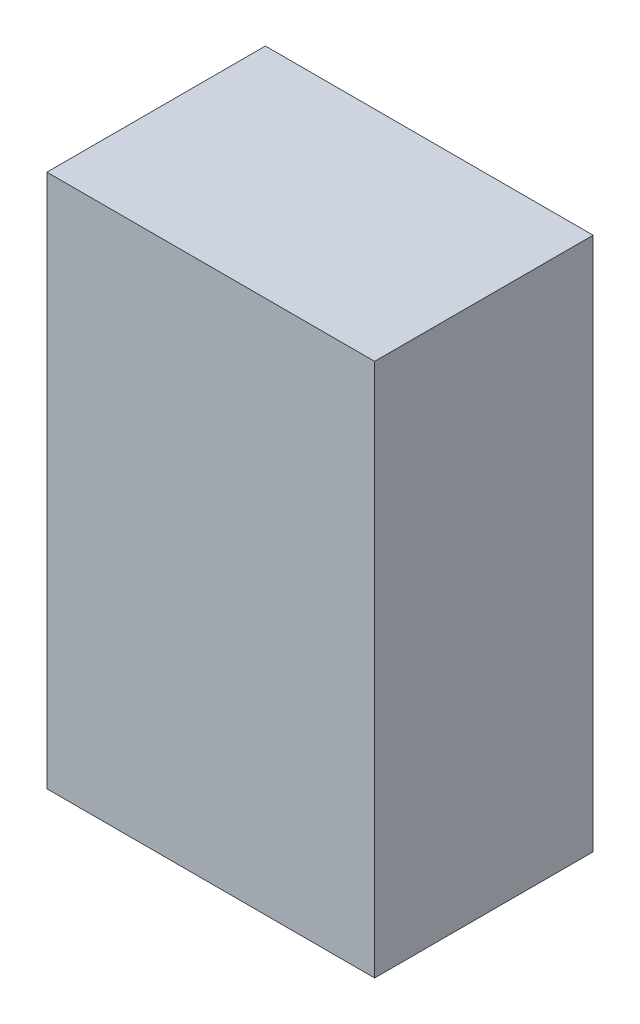
ISO-10303-21;
HEADER;
FILE_DESCRIPTION(('STEP AP214'),'2;1');
FILE_NAME('part.step','',(''),(''),'','','');
FILE_SCHEMA(('AUTOMOTIVE_DESIGN { 1 0 10303 214 1 1 1 1 }'));
ENDSEC;
DATA;
#1=APPLICATION_CONTEXT('core data for automotive mechanical design processes');
#2=APPLICATION_PROTOCOL_DEFINITION('international standard','automotive_design',2000,#1);
#3=PRODUCT_CONTEXT('',#1,'mechanical');
#4=PRODUCT('Part','Part','',(#3));
#5=PRODUCT_RELATED_PRODUCT_CATEGORY('part','',(#4));
#6=PRODUCT_DEFINITION_FORMATION('','',#4);
#7=PRODUCT_DEFINITION_CONTEXT('part definition',#1,'design');
#8=PRODUCT_DEFINITION('design','',#6,#7);
#9=PRODUCT_DEFINITION_SHAPE('','',#8);
#10=(LENGTH_UNIT() NAMED_UNIT(*) SI_UNIT(.MILLI.,.METRE.));
#11=(NAMED_UNIT(*) PLANE_ANGLE_UNIT() SI_UNIT($,.RADIAN.));
#12=(NAMED_UNIT(*) SI_UNIT($,.STERADIAN.) SOLID_ANGLE_UNIT());
#13=UNCERTAINTY_MEASURE_WITH_UNIT(LENGTH_MEASURE(1.E-05),#10,'distance_accuracy_value','');
#14=(GEOMETRIC_REPRESENTATION_CONTEXT(3) GLOBAL_UNCERTAINTY_ASSIGNED_CONTEXT((#13)) GLOBAL_UNIT_ASSIGNED_CONTEXT((#10,
#11,#12)) REPRESENTATION_CONTEXT('',''));
#15=CARTESIAN_POINT('',(0.,0.,0.));
#16=DIRECTION('',(0.,0.,1.));
#17=DIRECTION('',(1.,0.,0.));
#18=AXIS2_PLACEMENT_3D('',#15,#16,#17);
#19=CARTESIAN_POINT('',(-0.67499992,1.10000034,0.90000074));
#20=DIRECTION('',(0.,0.,-1.));
#21=DIRECTION('',(-1.,0.,0.));
#22=AXIS2_PLACEMENT_3D('',#19,#20,#21);
#23=PLANE('',#22);
#24=DIRECTION('',(1.,0.,0.));
#25=VECTOR('',#24,1.);
#26=CARTESIAN_POINT('',(-0.67499992,-1.0999978,0.90000074));
#27=LINE('',#26,#25);
#28=CARTESIAN_POINT('',(-0.67499992,-1.0999978,0.90000074));
#29=VERTEX_POINT('',#28);
#30=CARTESIAN_POINT('',(0.67499992,-1.0999978,0.90000074));
#31=VERTEX_POINT('',#30);
#32=EDGE_CURVE('E55',#29,#31,#27,.T.);
#33=ORIENTED_EDGE('',*,*,#32,.T.);
#34=DIRECTION('',(0.,1.,0.));
#35=VECTOR('',#34,1.);
#36=CARTESIAN_POINT('',(0.67499992,-1.0999978,0.90000074));
#37=LINE('',#36,#35);
#38=CARTESIAN_POINT('',(0.67499992,1.10000034,0.90000074));
#39=VERTEX_POINT('',#38);
#40=EDGE_CURVE('E57',#31,#39,#37,.T.);
#41=ORIENTED_EDGE('',*,*,#40,.T.);
#42=DIRECTION('',(1.,0.,0.));
#43=VECTOR('',#42,1.);
#44=CARTESIAN_POINT('',(0.67499992,1.10000034,0.90000074));
#45=LINE('',#44,#43);
#46=CARTESIAN_POINT('',(-0.67499992,1.10000034,0.90000074));
#47=VERTEX_POINT('',#46);
#48=EDGE_CURVE('E20',#39,#47,#45,.F.);
#49=ORIENTED_EDGE('',*,*,#48,.T.);
#50=DIRECTION('',(0.,1.,0.));
#51=VECTOR('',#50,1.);
#52=CARTESIAN_POINT('',(-0.67499992,1.10000034,0.90000074));
#53=LINE('',#52,#51);
#54=EDGE_CURVE('E80',#47,#29,#53,.F.);
#55=ORIENTED_EDGE('',*,*,#54,.T.);
#56=EDGE_LOOP('',(#33,#41,#49,#55));
#57=FACE_BOUND('',#56,.T.);
#58=ADVANCED_FACE('F17',(#57),#23,.F.);
#59=CARTESIAN_POINT('',(0.67499992,1.10000034,0.));
#60=DIRECTION('',(0.,-1.,0.));
#61=DIRECTION('',(0.,0.,-1.));
#62=AXIS2_PLACEMENT_3D('',#59,#60,#61);
#63=PLANE('',#62);
#64=DIRECTION('',(0.,0.,-1.));
#65=VECTOR('',#64,1.);
#66=CARTESIAN_POINT('',(-0.67499992,1.10000034,0.));
#67=LINE('',#66,#65);
#68=CARTESIAN_POINT('',(-0.67499992,1.10000034,0.));
#69=VERTEX_POINT('',#68);
#70=EDGE_CURVE('E68',#69,#47,#67,.F.);
#71=ORIENTED_EDGE('',*,*,#70,.T.);
#72=ORIENTED_EDGE('',*,*,#48,.F.);
#73=DIRECTION('',(0.,0.,1.));
#74=VECTOR('',#73,1.);
#75=CARTESIAN_POINT('',(0.67499992,1.10000034,0.));
#76=LINE('',#75,#74);
#77=CARTESIAN_POINT('',(0.67499992,1.10000034,0.));
#78=VERTEX_POINT('',#77);
#79=EDGE_CURVE('E63',#39,#78,#76,.F.);
#80=ORIENTED_EDGE('',*,*,#79,.T.);
#81=DIRECTION('',(-1.,0.,0.));
#82=VECTOR('',#81,1.);
#83=CARTESIAN_POINT('',(-0.67499992,1.10000034,0.));
#84=LINE('',#83,#82);
#85=EDGE_CURVE('E83',#69,#78,#84,.F.);
#86=ORIENTED_EDGE('',*,*,#85,.F.);
#87=EDGE_LOOP('',(#71,#72,#80,#86));
#88=FACE_BOUND('',#87,.T.);
#89=ADVANCED_FACE('F65',(#88),#63,.F.);
#90=CARTESIAN_POINT('',(0.67499992,-1.0999978,0.));
#91=DIRECTION('',(-1.,0.,0.));
#92=DIRECTION('',(0.,0.,1.));
#93=AXIS2_PLACEMENT_3D('',#90,#91,#92);
#94=PLANE('',#93);
#95=ORIENTED_EDGE('',*,*,#79,.F.);
#96=ORIENTED_EDGE('',*,*,#40,.F.);
#97=DIRECTION('',(0.,0.,1.));
#98=VECTOR('',#97,1.);
#99=CARTESIAN_POINT('',(0.67499992,-1.0999978,0.));
#100=LINE('',#99,#98);
#101=CARTESIAN_POINT('',(0.67499992,-1.0999978,0.));
#102=VERTEX_POINT('',#101);
#103=EDGE_CURVE('E75',#31,#102,#100,.F.);
#104=ORIENTED_EDGE('',*,*,#103,.T.);
#105=DIRECTION('',(0.,1.,0.));
#106=VECTOR('',#105,1.);
#107=CARTESIAN_POINT('',(0.67499992,1.10000034,0.));
#108=LINE('',#107,#106);
#109=EDGE_CURVE('E72',#78,#102,#108,.F.);
#110=ORIENTED_EDGE('',*,*,#109,.F.);
#111=EDGE_LOOP('',(#95,#96,#104,#110));
#112=FACE_BOUND('',#111,.T.);
#113=ADVANCED_FACE('F70',(#112),#94,.F.);
#114=CARTESIAN_POINT('',(-0.67499992,-1.0999978,0.));
#115=DIRECTION('',(0.,1.,0.));
#116=DIRECTION('',(0.,0.,1.));
#117=AXIS2_PLACEMENT_3D('',#114,#115,#116);
#118=PLANE('',#117);
#119=ORIENTED_EDGE('',*,*,#103,.F.);
#120=ORIENTED_EDGE('',*,*,#32,.F.);
#121=DIRECTION('',(0.,0.,-1.));
#122=VECTOR('',#121,1.);
#123=CARTESIAN_POINT('',(-0.67499992,-1.0999978,0.));
#124=LINE('',#123,#122);
#125=CARTESIAN_POINT('',(-0.67499992,-1.0999978,0.));
#126=VERTEX_POINT('',#125);
#127=EDGE_CURVE('E35',#29,#126,#124,.T.);
#128=ORIENTED_EDGE('',*,*,#127,.T.);
#129=DIRECTION('',(-1.,0.,0.));
#130=VECTOR('',#129,1.);
#131=CARTESIAN_POINT('',(-0.67499992,-1.0999978,0.));
#132=LINE('',#131,#130);
#133=EDGE_CURVE('E26',#102,#126,#132,.T.);
#134=ORIENTED_EDGE('',*,*,#133,.F.);
#135=EDGE_LOOP('',(#119,#120,#128,#134));
#136=FACE_BOUND('',#135,.T.);
#137=ADVANCED_FACE('F89',(#136),#118,.F.);
#138=CARTESIAN_POINT('',(-0.67499992,1.10000034,0.));
#139=DIRECTION('',(1.,0.,0.));
#140=DIRECTION('',(0.,0.,-1.));
#141=AXIS2_PLACEMENT_3D('',#138,#139,#140);
#142=PLANE('',#141);
#143=ORIENTED_EDGE('',*,*,#127,.F.);
#144=ORIENTED_EDGE('',*,*,#54,.F.);
#145=ORIENTED_EDGE('',*,*,#70,.F.);
#146=DIRECTION('',(0.,1.,0.));
#147=VECTOR('',#146,1.);
#148=CARTESIAN_POINT('',(-0.67499992,1.10000034,0.));
#149=LINE('',#148,#147);
#150=EDGE_CURVE('E11',#126,#69,#149,.T.);
#151=ORIENTED_EDGE('',*,*,#150,.F.);
#152=EDGE_LOOP('',(#143,#144,#145,#151));
#153=FACE_BOUND('',#152,.T.);
#154=ADVANCED_FACE('F91',(#153),#142,.F.);
#155=CARTESIAN_POINT('',(-0.67499992,1.10000034,0.));
#156=DIRECTION('',(0.,0.,-1.));
#157=DIRECTION('',(-1.,0.,0.));
#158=AXIS2_PLACEMENT_3D('',#155,#156,#157);
#159=PLANE('',#158);
#160=ORIENTED_EDGE('',*,*,#133,.T.);
#161=ORIENTED_EDGE('',*,*,#150,.T.);
#162=ORIENTED_EDGE('',*,*,#85,.T.);
#163=ORIENTED_EDGE('',*,*,#109,.T.);
#164=EDGE_LOOP('',(#160,#161,#162,#163));
#165=FACE_BOUND('',#164,.T.);
#166=ADVANCED_FACE('F88',(#165),#159,.T.);
#167=CLOSED_SHELL('',(#58,#89,#113,#137,#154,#166));
#168=MANIFOLD_SOLID_BREP('B1',#167);
#169=ADVANCED_BREP_SHAPE_REPRESENTATION('',(#18,#168),#14);
#170=SHAPE_DEFINITION_REPRESENTATION(#9,#169);
ENDSEC;
END-ISO-10303-21;
